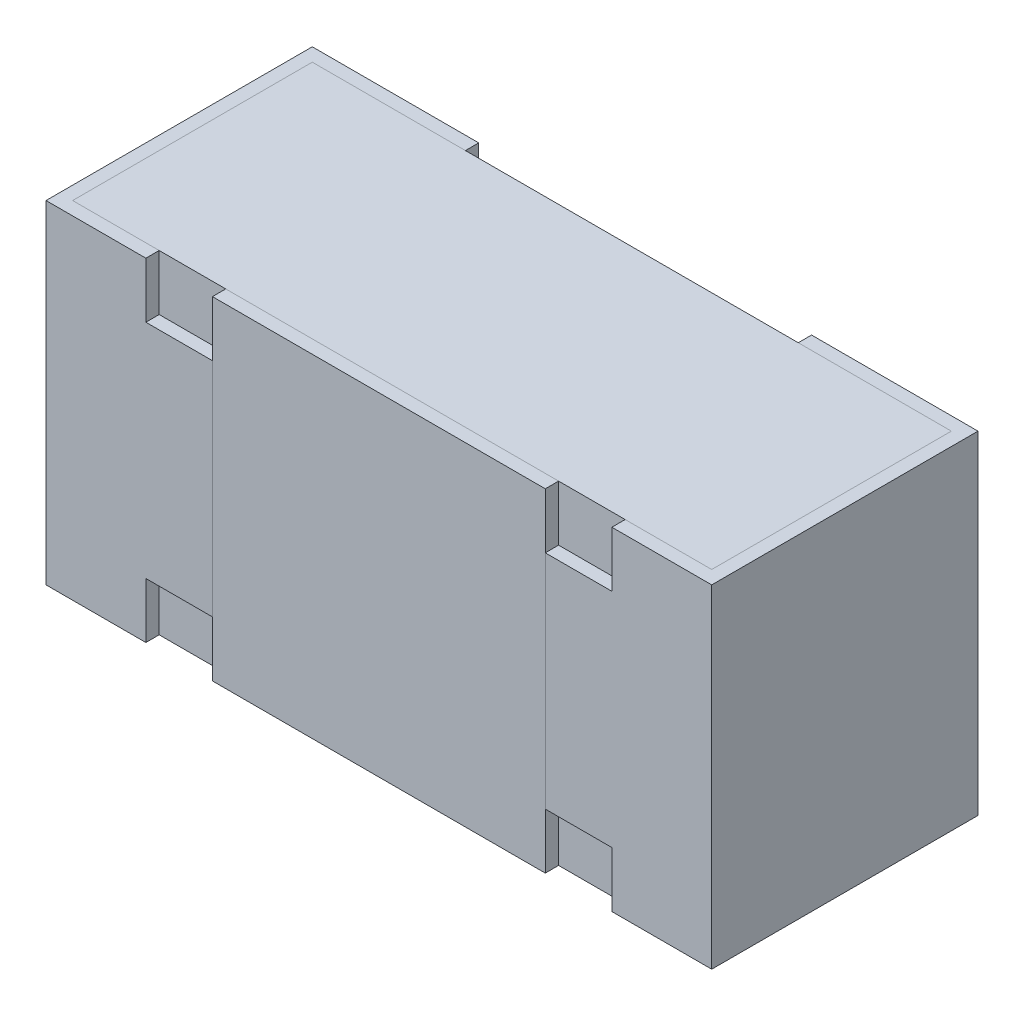
ISO-10303-21;
HEADER;
FILE_DESCRIPTION(('STEP AP214'),'2;1');
FILE_NAME('part.step','',(''),(''),'','','');
FILE_SCHEMA(('AUTOMOTIVE_DESIGN { 1 0 10303 214 1 1 1 1 }'));
ENDSEC;
DATA;
#1=APPLICATION_CONTEXT('core data for automotive mechanical design processes');
#2=APPLICATION_PROTOCOL_DEFINITION('international standard','automotive_design',2000,#1);
#3=PRODUCT_CONTEXT('',#1,'mechanical');
#4=PRODUCT('Part','Part','',(#3));
#5=PRODUCT_RELATED_PRODUCT_CATEGORY('part','',(#4));
#6=PRODUCT_DEFINITION_FORMATION('','',#4);
#7=PRODUCT_DEFINITION_CONTEXT('part definition',#1,'design');
#8=PRODUCT_DEFINITION('design','',#6,#7);
#9=PRODUCT_DEFINITION_SHAPE('','',#8);
#10=(LENGTH_UNIT() NAMED_UNIT(*) SI_UNIT(.MILLI.,.METRE.));
#11=(NAMED_UNIT(*) PLANE_ANGLE_UNIT() SI_UNIT($,.RADIAN.));
#12=(NAMED_UNIT(*) SI_UNIT($,.STERADIAN.) SOLID_ANGLE_UNIT());
#13=UNCERTAINTY_MEASURE_WITH_UNIT(LENGTH_MEASURE(1.E-05),#10,'distance_accuracy_value','');
#14=(GEOMETRIC_REPRESENTATION_CONTEXT(3) GLOBAL_UNCERTAINTY_ASSIGNED_CONTEXT((#13)) GLOBAL_UNIT_ASSIGNED_CONTEXT((#10,
#11,#12)) REPRESENTATION_CONTEXT('',''));
#15=CARTESIAN_POINT('',(0.,0.,0.));
#16=DIRECTION('',(0.,0.,1.));
#17=DIRECTION('',(1.,0.,0.));
#18=AXIS2_PLACEMENT_3D('',#15,#16,#17);
#19=CARTESIAN_POINT('',(6.34999999999694E-05,-0.24990348,0.01278128));
#20=DIRECTION('',(0.,-1.,0.));
#21=DIRECTION('',(1.,0.,0.));
#22=AXIS2_PLACEMENT_3D('',#19,#20,#21);
#23=PLANE('',#22);
#24=DIRECTION('',(0.,0.,-1.));
#25=VECTOR('',#24,1.);
#26=CARTESIAN_POINT('',(0.480063499999999,-0.24990348,0.0327812800000001));
#27=LINE('',#26,#25);
#28=CARTESIAN_POINT('',(0.480063499999999,-0.24990348,0.39278128));
#29=VERTEX_POINT('',#28);
#30=CARTESIAN_POINT('',(0.480063499999999,-0.24990348,0.0327812800000001));
#31=VERTEX_POINT('',#30);
#32=EDGE_CURVE('P0_E10',#29,#31,#27,.T.);
#33=ORIENTED_EDGE('',*,*,#32,.F.);
#34=DIRECTION('',(1.,0.,0.));
#35=VECTOR('',#34,1.);
#36=CARTESIAN_POINT('',(0.480063499999999,-0.24990348,0.39278128));
#37=LINE('',#36,#35);
#38=CARTESIAN_POINT('',(-0.4799365,-0.24990348,0.39278128));
#39=VERTEX_POINT('',#38);
#40=EDGE_CURVE('P0_E23',#39,#29,#37,.T.);
#41=ORIENTED_EDGE('',*,*,#40,.F.);
#42=DIRECTION('',(0.,0.,1.));
#43=VECTOR('',#42,1.);
#44=CARTESIAN_POINT('',(-0.4799365,-0.24990348,0.0327812800000001));
#45=LINE('',#44,#43);
#46=CARTESIAN_POINT('',(-0.4799365,-0.24990348,0.0327812800000001));
#47=VERTEX_POINT('',#46);
#48=EDGE_CURVE('P0_E68',#47,#39,#45,.T.);
#49=ORIENTED_EDGE('',*,*,#48,.F.);
#50=DIRECTION('',(-1.,0.,0.));
#51=VECTOR('',#50,1.);
#52=CARTESIAN_POINT('',(0.480063499999999,-0.24990348,0.0327812800000001));
#53=LINE('',#52,#51);
#54=EDGE_CURVE('P0_E83',#31,#47,#53,.T.);
#55=ORIENTED_EDGE('',*,*,#54,.F.);
#56=EDGE_LOOP('',(#33,#41,#49,#55));
#57=FACE_BOUND('',#56,.T.);
#58=ADVANCED_FACE('P0_F16',(#57),#23,.T.);
#59=CARTESIAN_POINT('',(6.35000000000306E-05,0.25009652,0.01278128));
#60=DIRECTION('',(0.,-1.,0.));
#61=DIRECTION('',(1.,0.,0.));
#62=AXIS2_PLACEMENT_3D('',#59,#60,#61);
#63=PLANE('',#62);
#64=DIRECTION('',(0.,0.,-1.));
#65=VECTOR('',#64,1.);
#66=CARTESIAN_POINT('',(0.4800635,0.25009652,0.0327812800000001));
#67=LINE('',#66,#65);
#68=CARTESIAN_POINT('',(0.4800635,0.25009652,0.39278128));
#69=VERTEX_POINT('',#68);
#70=CARTESIAN_POINT('',(0.4800635,0.25009652,0.0327812800000001));
#71=VERTEX_POINT('',#70);
#72=EDGE_CURVE('P0_E81',#69,#71,#67,.T.);
#73=ORIENTED_EDGE('',*,*,#72,.T.);
#74=DIRECTION('',(-1.,0.,0.));
#75=VECTOR('',#74,1.);
#76=CARTESIAN_POINT('',(0.4800635,0.25009652,0.0327812800000001));
#77=LINE('',#76,#75);
#78=CARTESIAN_POINT('',(-0.479936499999999,0.25009652,0.0327812800000001));
#79=VERTEX_POINT('',#78);
#80=EDGE_CURVE('P0_E60',#71,#79,#77,.T.);
#81=ORIENTED_EDGE('',*,*,#80,.T.);
#82=DIRECTION('',(0.,0.,1.));
#83=VECTOR('',#82,1.);
#84=CARTESIAN_POINT('',(-0.479936499999999,0.25009652,0.0327812800000001));
#85=LINE('',#84,#83);
#86=CARTESIAN_POINT('',(-0.479936499999999,0.25009652,0.39278128));
#87=VERTEX_POINT('',#86);
#88=EDGE_CURVE('P0_E53',#79,#87,#85,.T.);
#89=ORIENTED_EDGE('',*,*,#88,.T.);
#90=DIRECTION('',(1.,0.,0.));
#91=VECTOR('',#90,1.);
#92=CARTESIAN_POINT('',(0.4800635,0.25009652,0.39278128));
#93=LINE('',#92,#91);
#94=EDGE_CURVE('P0_E57',#87,#69,#93,.T.);
#95=ORIENTED_EDGE('',*,*,#94,.T.);
#96=EDGE_LOOP('',(#73,#81,#89,#95));
#97=FACE_BOUND('',#96,.T.);
#98=ADVANCED_FACE('P0_F55',(#97),#63,.F.);
#99=CARTESIAN_POINT('',(0.480063499999999,-1.2751839294381,0.03278128));
#100=DIRECTION('',(0.,0.,-1.));
#101=DIRECTION('',(-1.,0.,0.));
#102=AXIS2_PLACEMENT_3D('',#99,#100,#101);
#103=PLANE('',#102);
#104=DIRECTION('',(0.,1.,0.));
#105=VECTOR('',#104,1.);
#106=CARTESIAN_POINT('',(0.480063499999999,-1.2751839294381,0.03278128));
#107=LINE('',#106,#105);
#108=EDGE_CURVE('P0_E75',#31,#71,#107,.T.);
#109=ORIENTED_EDGE('',*,*,#108,.F.);
#110=ORIENTED_EDGE('',*,*,#54,.T.);
#111=DIRECTION('',(0.,1.,0.));
#112=VECTOR('',#111,1.);
#113=CARTESIAN_POINT('',(-0.4799365,-1.2751839294381,0.03278128));
#114=LINE('',#113,#112);
#115=EDGE_CURVE('P0_E70',#47,#79,#114,.T.);
#116=ORIENTED_EDGE('',*,*,#115,.T.);
#117=ORIENTED_EDGE('',*,*,#80,.F.);
#118=EDGE_LOOP('',(#109,#110,#116,#117));
#119=FACE_BOUND('',#118,.T.);
#120=ADVANCED_FACE('P0_F90',(#119),#103,.T.);
#121=CARTESIAN_POINT('',(-0.4799365,-1.2751839294381,0.03278128));
#122=DIRECTION('',(-1.,0.,0.));
#123=DIRECTION('',(0.,-1.,0.));
#124=AXIS2_PLACEMENT_3D('',#121,#122,#123);
#125=PLANE('',#124);
#126=ORIENTED_EDGE('',*,*,#115,.F.);
#127=ORIENTED_EDGE('',*,*,#48,.T.);
#128=DIRECTION('',(0.,1.,0.));
#129=VECTOR('',#128,1.);
#130=CARTESIAN_POINT('',(-0.4799365,-1.2751839294381,0.39278128));
#131=LINE('',#130,#129);
#132=EDGE_CURVE('P0_E65',#39,#87,#131,.T.);
#133=ORIENTED_EDGE('',*,*,#132,.T.);
#134=ORIENTED_EDGE('',*,*,#88,.F.);
#135=EDGE_LOOP('',(#126,#127,#133,#134));
#136=FACE_BOUND('',#135,.T.);
#137=ADVANCED_FACE('P0_F66',(#136),#125,.T.);
#138=CARTESIAN_POINT('',(0.480063499999999,-1.2751839294381,0.39278128));
#139=DIRECTION('',(0.,0.,1.));
#140=DIRECTION('',(0.,1.,0.));
#141=AXIS2_PLACEMENT_3D('',#138,#139,#140);
#142=PLANE('',#141);
#143=ORIENTED_EDGE('',*,*,#132,.F.);
#144=ORIENTED_EDGE('',*,*,#40,.T.);
#145=DIRECTION('',(0.,1.,0.));
#146=VECTOR('',#145,1.);
#147=CARTESIAN_POINT('',(0.480063499999999,-1.2751839294381,0.39278128));
#148=LINE('',#147,#146);
#149=EDGE_CURVE('P0_E71',#29,#69,#148,.T.);
#150=ORIENTED_EDGE('',*,*,#149,.T.);
#151=ORIENTED_EDGE('',*,*,#94,.F.);
#152=EDGE_LOOP('',(#143,#144,#150,#151));
#153=FACE_BOUND('',#152,.T.);
#154=ADVANCED_FACE('P0_F73',(#153),#142,.T.);
#155=CARTESIAN_POINT('',(0.480063499999999,-1.2751839294381,0.03278128));
#156=DIRECTION('',(1.,0.,0.));
#157=DIRECTION('',(0.,1.,0.));
#158=AXIS2_PLACEMENT_3D('',#155,#156,#157);
#159=PLANE('',#158);
#160=ORIENTED_EDGE('',*,*,#149,.F.);
#161=ORIENTED_EDGE('',*,*,#32,.T.);
#162=ORIENTED_EDGE('',*,*,#108,.T.);
#163=ORIENTED_EDGE('',*,*,#72,.F.);
#164=EDGE_LOOP('',(#160,#161,#162,#163));
#165=FACE_BOUND('',#164,.T.);
#166=ADVANCED_FACE('P0_F86',(#165),#159,.T.);
#167=CLOSED_SHELL('',(#58,#98,#120,#137,#154,#166));
#168=MANIFOLD_SOLID_BREP('P0_B1',#167);
#169=CARTESIAN_POINT('',(0.2500635,-0.24990348,-0.314325501186547));
#170=DIRECTION('',(1.,0.,0.));
#171=DIRECTION('',(0.,1.,0.));
#172=AXIS2_PLACEMENT_3D('',#169,#170,#171);
#173=PLANE('',#172);
#174=DIRECTION('',(0.,-1.,0.));
#175=VECTOR('',#174,1.);
#176=CARTESIAN_POINT('',(0.2500635,-0.24990348,0.39278128));
#177=LINE('',#176,#175);
#178=CARTESIAN_POINT('',(0.250063499999999,0.25009652,0.39278128));
#179=VERTEX_POINT('',#178);
#180=CARTESIAN_POINT('',(0.2500635,-0.24990348,0.39278128));
#181=VERTEX_POINT('',#180);
#182=EDGE_CURVE('P1_E11',#179,#181,#177,.T.);
#183=ORIENTED_EDGE('',*,*,#182,.F.);
#184=DIRECTION('',(0.,0.,1.));
#185=VECTOR('',#184,1.);
#186=CARTESIAN_POINT('',(0.250063499999999,0.25009652,-0.314325501186547));
#187=LINE('',#186,#185);
#188=CARTESIAN_POINT('',(0.250063499999999,0.25009652,0.41278128));
#189=VERTEX_POINT('',#188);
#190=EDGE_CURVE('P1_E24',#179,#189,#187,.T.);
#191=ORIENTED_EDGE('',*,*,#190,.T.);
#192=DIRECTION('',(0.,1.,0.));
#193=VECTOR('',#192,1.);
#194=CARTESIAN_POINT('',(0.2500635,-0.24990348,0.41278128));
#195=LINE('',#194,#193);
#196=CARTESIAN_POINT('',(0.2500635,-0.24990348,0.41278128));
#197=VERTEX_POINT('',#196);
#198=EDGE_CURVE('P1_E72',#197,#189,#195,.T.);
#199=ORIENTED_EDGE('',*,*,#198,.F.);
#200=DIRECTION('',(0.,0.,1.));
#201=VECTOR('',#200,1.);
#202=CARTESIAN_POINT('',(0.2500635,-0.24990348,-0.314325501186547));
#203=LINE('',#202,#201);
#204=EDGE_CURVE('P1_E86',#181,#197,#203,.T.);
#205=ORIENTED_EDGE('',*,*,#204,.F.);
#206=EDGE_LOOP('',(#183,#191,#199,#205));
#207=FACE_BOUND('',#206,.T.);
#208=ADVANCED_FACE('P1_F17',(#207),#173,.T.);
#209=CARTESIAN_POINT('',(0.2500635,-0.24990348,-0.314325501186547));
#210=DIRECTION('',(0.,-1.,0.));
#211=DIRECTION('',(1.,0.,0.));
#212=AXIS2_PLACEMENT_3D('',#209,#210,#211);
#213=PLANE('',#212);
#214=DIRECTION('',(-1.,0.,0.));
#215=VECTOR('',#214,1.);
#216=CARTESIAN_POINT('',(0.2500635,-0.24990348,0.39278128));
#217=LINE('',#216,#215);
#218=CARTESIAN_POINT('',(-0.2499365,-0.24990348,0.39278128));
#219=VERTEX_POINT('',#218);
#220=EDGE_CURVE('P1_E84',#181,#219,#217,.T.);
#221=ORIENTED_EDGE('',*,*,#220,.F.);
#222=ORIENTED_EDGE('',*,*,#204,.T.);
#223=DIRECTION('',(1.,0.,0.));
#224=VECTOR('',#223,1.);
#225=CARTESIAN_POINT('',(0.2500635,-0.24990348,0.41278128));
#226=LINE('',#225,#224);
#227=CARTESIAN_POINT('',(-0.2499365,-0.24990348,0.41278128));
#228=VERTEX_POINT('',#227);
#229=EDGE_CURVE('P1_E82',#228,#197,#226,.T.);
#230=ORIENTED_EDGE('',*,*,#229,.F.);
#231=DIRECTION('',(0.,0.,1.));
#232=VECTOR('',#231,1.);
#233=CARTESIAN_POINT('',(-0.2499365,-0.24990348,-0.314325501186547));
#234=LINE('',#233,#232);
#235=EDGE_CURVE('P1_E75',#219,#228,#234,.T.);
#236=ORIENTED_EDGE('',*,*,#235,.F.);
#237=EDGE_LOOP('',(#221,#222,#230,#236));
#238=FACE_BOUND('',#237,.T.);
#239=ADVANCED_FACE('P1_F90',(#238),#213,.T.);
#240=CARTESIAN_POINT('',(-0.2499365,-0.24990348,-0.314325501186547));
#241=DIRECTION('',(-1.,0.,0.));
#242=DIRECTION('',(0.,0.,1.));
#243=AXIS2_PLACEMENT_3D('',#240,#241,#242);
#244=PLANE('',#243);
#245=DIRECTION('',(0.,1.,0.));
#246=VECTOR('',#245,1.);
#247=CARTESIAN_POINT('',(-0.2499365,-0.24990348,0.39278128));
#248=LINE('',#247,#246);
#249=CARTESIAN_POINT('',(-0.2499365,0.25009652,0.39278128));
#250=VERTEX_POINT('',#249);
#251=EDGE_CURVE('P1_E76',#219,#250,#248,.T.);
#252=ORIENTED_EDGE('',*,*,#251,.F.);
#253=ORIENTED_EDGE('',*,*,#235,.T.);
#254=DIRECTION('',(0.,-1.,0.));
#255=VECTOR('',#254,1.);
#256=CARTESIAN_POINT('',(-0.2499365,-0.24990348,0.41278128));
#257=LINE('',#256,#255);
#258=CARTESIAN_POINT('',(-0.2499365,0.25009652,0.41278128));
#259=VERTEX_POINT('',#258);
#260=EDGE_CURVE('P1_E64',#259,#228,#257,.T.);
#261=ORIENTED_EDGE('',*,*,#260,.F.);
#262=DIRECTION('',(0.,0.,1.));
#263=VECTOR('',#262,1.);
#264=CARTESIAN_POINT('',(-0.2499365,0.25009652,-0.314325501186547));
#265=LINE('',#264,#263);
#266=EDGE_CURVE('P1_E53',#250,#259,#265,.T.);
#267=ORIENTED_EDGE('',*,*,#266,.F.);
#268=EDGE_LOOP('',(#252,#253,#261,#267));
#269=FACE_BOUND('',#268,.T.);
#270=ADVANCED_FACE('P1_F74',(#269),#244,.T.);
#271=CARTESIAN_POINT('',(0.250063499999999,0.25009652,-0.314325501186547));
#272=DIRECTION('',(0.,1.,0.));
#273=DIRECTION('',(-1.,0.,0.));
#274=AXIS2_PLACEMENT_3D('',#271,#272,#273);
#275=PLANE('',#274);
#276=DIRECTION('',(1.,0.,0.));
#277=VECTOR('',#276,1.);
#278=CARTESIAN_POINT('',(0.250063499999999,0.25009652,0.39278128));
#279=LINE('',#278,#277);
#280=EDGE_CURVE('P1_E59',#250,#179,#279,.T.);
#281=ORIENTED_EDGE('',*,*,#280,.F.);
#282=ORIENTED_EDGE('',*,*,#266,.T.);
#283=DIRECTION('',(-1.,0.,0.));
#284=VECTOR('',#283,1.);
#285=CARTESIAN_POINT('',(0.250063499999999,0.25009652,0.41278128));
#286=LINE('',#285,#284);
#287=EDGE_CURVE('P1_E57',#189,#259,#286,.T.);
#288=ORIENTED_EDGE('',*,*,#287,.F.);
#289=ORIENTED_EDGE('',*,*,#190,.F.);
#290=EDGE_LOOP('',(#281,#282,#288,#289));
#291=FACE_BOUND('',#290,.T.);
#292=ADVANCED_FACE('P1_F55',(#291),#275,.T.);
#293=CARTESIAN_POINT('',(6.35E-05,9.65199999999755E-05,0.41278128));
#294=DIRECTION('',(0.,0.,1.));
#295=DIRECTION('',(0.,1.,0.));
#296=AXIS2_PLACEMENT_3D('',#293,#294,#295);
#297=PLANE('',#296);
#298=ORIENTED_EDGE('',*,*,#198,.T.);
#299=ORIENTED_EDGE('',*,*,#287,.T.);
#300=ORIENTED_EDGE('',*,*,#260,.T.);
#301=ORIENTED_EDGE('',*,*,#229,.T.);
#302=EDGE_LOOP('',(#298,#299,#300,#301));
#303=FACE_BOUND('',#302,.T.);
#304=ADVANCED_FACE('P1_F68',(#303),#297,.T.);
#305=CARTESIAN_POINT('',(0.480063499999999,-1.2751839294381,0.39278128));
#306=DIRECTION('',(0.,0.,1.));
#307=DIRECTION('',(0.,1.,0.));
#308=AXIS2_PLACEMENT_3D('',#305,#306,#307);
#309=PLANE('',#308);
#310=ORIENTED_EDGE('',*,*,#182,.T.);
#311=ORIENTED_EDGE('',*,*,#220,.T.);
#312=ORIENTED_EDGE('',*,*,#251,.T.);
#313=ORIENTED_EDGE('',*,*,#280,.T.);
#314=EDGE_LOOP('',(#310,#311,#312,#313));
#315=FACE_BOUND('',#314,.T.);
#316=ADVANCED_FACE('P1_F91',(#315),#309,.F.);
#317=CLOSED_SHELL('',(#208,#239,#270,#292,#304,#316));
#318=MANIFOLD_SOLID_BREP('P1_B1',#317);
#319=CARTESIAN_POINT('',(0.2500635,0.25009652,0.0327812800000001));
#320=DIRECTION('',(1.,0.,0.));
#321=DIRECTION('',(0.,1.,0.));
#322=AXIS2_PLACEMENT_3D('',#319,#320,#321);
#323=PLANE('',#322);
#324=DIRECTION('',(0.,0.,1.));
#325=VECTOR('',#324,1.);
#326=CARTESIAN_POINT('',(0.2500635,-0.24990348,0.0327812800000001));
#327=LINE('',#326,#325);
#328=CARTESIAN_POINT('',(0.2500635,-0.24990348,0.01278128));
#329=VERTEX_POINT('',#328);
#330=CARTESIAN_POINT('',(0.2500635,-0.24990348,0.0327812800000001));
#331=VERTEX_POINT('',#330);
#332=EDGE_CURVE('P2_E11',#329,#331,#327,.T.);
#333=ORIENTED_EDGE('',*,*,#332,.T.);
#334=DIRECTION('',(0.,-1.,0.));
#335=VECTOR('',#334,1.);
#336=CARTESIAN_POINT('',(0.2500635,0.25009652,0.0327812800000001));
#337=LINE('',#336,#335);
#338=CARTESIAN_POINT('',(0.2500635,0.25009652,0.0327812800000001));
#339=VERTEX_POINT('',#338);
#340=EDGE_CURVE('P2_E24',#339,#331,#337,.T.);
#341=ORIENTED_EDGE('',*,*,#340,.F.);
#342=DIRECTION('',(0.,0.,1.));
#343=VECTOR('',#342,1.);
#344=CARTESIAN_POINT('',(0.2500635,0.25009652,0.0327812800000001));
#345=LINE('',#344,#343);
#346=CARTESIAN_POINT('',(0.2500635,0.25009652,0.01278128));
#347=VERTEX_POINT('',#346);
#348=EDGE_CURVE('P2_E186',#347,#339,#345,.T.);
#349=ORIENTED_EDGE('',*,*,#348,.F.);
#350=DIRECTION('',(0.,-1.,0.));
#351=VECTOR('',#350,1.);
#352=CARTESIAN_POINT('',(0.2500635,0.25009652,0.01278128));
#353=LINE('',#352,#351);
#354=EDGE_CURVE('P2_E108',#347,#329,#353,.T.);
#355=ORIENTED_EDGE('',*,*,#354,.T.);
#356=EDGE_LOOP('',(#333,#341,#349,#355));
#357=FACE_BOUND('',#356,.T.);
#358=ADVANCED_FACE('P2_F17',(#357),#323,.F.);
#359=CARTESIAN_POINT('',(0.2500635,0.25009652,0.0327812800000001));
#360=DIRECTION('',(0.,0.,-1.));
#361=DIRECTION('',(-1.,0.,0.));
#362=AXIS2_PLACEMENT_3D('',#359,#360,#361);
#363=PLANE('',#362);
#364=DIRECTION('',(1.,0.,0.));
#365=VECTOR('',#364,1.);
#366=CARTESIAN_POINT('',(0.2500635,-0.24990348,0.0327812800000001));
#367=LINE('',#366,#365);
#368=CARTESIAN_POINT('',(0.480063499999999,-0.24990348,0.0327812800000001));
#369=VERTEX_POINT('',#368);
#370=EDGE_CURVE('P2_E183',#331,#369,#367,.T.);
#371=ORIENTED_EDGE('',*,*,#370,.T.);
#372=DIRECTION('',(0.,-1.,0.));
#373=VECTOR('',#372,1.);
#374=CARTESIAN_POINT('',(0.4800635,0.25009652,0.0327812800000001));
#375=LINE('',#374,#373);
#376=CARTESIAN_POINT('',(0.4800635,0.25009652,0.0327812800000001));
#377=VERTEX_POINT('',#376);
#378=EDGE_CURVE('P2_E180',#377,#369,#375,.T.);
#379=ORIENTED_EDGE('',*,*,#378,.F.);
#380=DIRECTION('',(1.,0.,0.));
#381=VECTOR('',#380,1.);
#382=CARTESIAN_POINT('',(0.2500635,0.25009652,0.0327812800000001));
#383=LINE('',#382,#381);
#384=EDGE_CURVE('P2_E177',#339,#377,#383,.T.);
#385=ORIENTED_EDGE('',*,*,#384,.F.);
#386=ORIENTED_EDGE('',*,*,#340,.T.);
#387=EDGE_LOOP('',(#371,#379,#385,#386));
#388=FACE_BOUND('',#387,.T.);
#389=ADVANCED_FACE('P2_F190',(#388),#363,.F.);
#390=CARTESIAN_POINT('',(0.4800635,0.25009652,0.0327812800000001));
#391=DIRECTION('',(1.,0.,0.));
#392=DIRECTION('',(0.,1.,0.));
#393=AXIS2_PLACEMENT_3D('',#390,#391,#392);
#394=PLANE('',#393);
#395=DIRECTION('',(0.,0.,1.));
#396=VECTOR('',#395,1.);
#397=CARTESIAN_POINT('',(0.480063499999999,-0.24990348,0.0327812800000001));
#398=LINE('',#397,#396);
#399=CARTESIAN_POINT('',(0.480063499999999,-0.24990348,0.39278128));
#400=VERTEX_POINT('',#399);
#401=EDGE_CURVE('P2_E174',#369,#400,#398,.T.);
#402=ORIENTED_EDGE('',*,*,#401,.T.);
#403=DIRECTION('',(0.,-1.,0.));
#404=VECTOR('',#403,1.);
#405=CARTESIAN_POINT('',(0.4800635,0.25009652,0.39278128));
#406=LINE('',#405,#404);
#407=CARTESIAN_POINT('',(0.4800635,0.25009652,0.39278128));
#408=VERTEX_POINT('',#407);
#409=EDGE_CURVE('P2_E171',#408,#400,#406,.T.);
#410=ORIENTED_EDGE('',*,*,#409,.F.);
#411=DIRECTION('',(0.,0.,1.));
#412=VECTOR('',#411,1.);
#413=CARTESIAN_POINT('',(0.4800635,0.25009652,0.0327812800000001));
#414=LINE('',#413,#412);
#415=EDGE_CURVE('P2_E169',#377,#408,#414,.T.);
#416=ORIENTED_EDGE('',*,*,#415,.F.);
#417=ORIENTED_EDGE('',*,*,#378,.T.);
#418=EDGE_LOOP('',(#402,#410,#416,#417));
#419=FACE_BOUND('',#418,.T.);
#420=ADVANCED_FACE('P2_F199',(#419),#394,.F.);
#421=CARTESIAN_POINT('',(0.4800635,0.25009652,0.39278128));
#422=DIRECTION('',(0.,0.,1.));
#423=DIRECTION('',(0.,1.,0.));
#424=AXIS2_PLACEMENT_3D('',#421,#422,#423);
#425=PLANE('',#424);
#426=DIRECTION('',(1.,0.,0.));
#427=VECTOR('',#426,1.);
#428=CARTESIAN_POINT('',(0.250063499999999,0.166763186666667,0.39278128));
#429=LINE('',#428,#427);
#430=CARTESIAN_POINT('',(0.250063499999999,0.166763186666667,0.39278128));
#431=VERTEX_POINT('',#430);
#432=CARTESIAN_POINT('',(0.350063499999999,0.166763186666667,0.39278128));
#433=VERTEX_POINT('',#432);
#434=EDGE_CURVE('P2_E167',#431,#433,#429,.T.);
#435=ORIENTED_EDGE('',*,*,#434,.T.);
#436=DIRECTION('',(0.,1.,0.));
#437=VECTOR('',#436,1.);
#438=CARTESIAN_POINT('',(0.3500635,0.25009652,0.39278128));
#439=LINE('',#438,#437);
#440=CARTESIAN_POINT('',(0.3500635,0.25009652,0.39278128));
#441=VERTEX_POINT('',#440);
#442=EDGE_CURVE('P2_E165',#433,#441,#439,.T.);
#443=ORIENTED_EDGE('',*,*,#442,.T.);
#444=DIRECTION('',(-1.,0.,0.));
#445=VECTOR('',#444,1.);
#446=CARTESIAN_POINT('',(0.4800635,0.25009652,0.39278128));
#447=LINE('',#446,#445);
#448=EDGE_CURVE('P2_E163',#408,#441,#447,.T.);
#449=ORIENTED_EDGE('',*,*,#448,.F.);
#450=ORIENTED_EDGE('',*,*,#409,.T.);
#451=DIRECTION('',(-1.,0.,0.));
#452=VECTOR('',#451,1.);
#453=CARTESIAN_POINT('',(0.480063499999999,-0.24990348,0.39278128));
#454=LINE('',#453,#452);
#455=CARTESIAN_POINT('',(0.350063499999999,-0.24990348,0.39278128));
#456=VERTEX_POINT('',#455);
#457=EDGE_CURVE('P2_E161',#400,#456,#454,.T.);
#458=ORIENTED_EDGE('',*,*,#457,.T.);
#459=DIRECTION('',(0.,1.,0.));
#460=VECTOR('',#459,1.);
#461=CARTESIAN_POINT('',(0.350063499999999,-0.24990348,0.39278128));
#462=LINE('',#461,#460);
#463=CARTESIAN_POINT('',(0.350063499999999,-0.166570146666667,0.39278128));
#464=VERTEX_POINT('',#463);
#465=EDGE_CURVE('P2_E159',#456,#464,#462,.T.);
#466=ORIENTED_EDGE('',*,*,#465,.T.);
#467=DIRECTION('',(-1.,0.,0.));
#468=VECTOR('',#467,1.);
#469=CARTESIAN_POINT('',(0.250063499999999,-0.166570146666667,0.39278128));
#470=LINE('',#469,#468);
#471=CARTESIAN_POINT('',(0.250063499999999,-0.166570146666667,0.39278128));
#472=VERTEX_POINT('',#471);
#473=EDGE_CURVE('P2_E156',#464,#472,#470,.T.);
#474=ORIENTED_EDGE('',*,*,#473,.T.);
#475=DIRECTION('',(0.,-1.,0.));
#476=VECTOR('',#475,1.);
#477=CARTESIAN_POINT('',(0.2500635,0.25009652,0.39278128));
#478=LINE('',#477,#476);
#479=EDGE_CURVE('P2_E153',#431,#472,#478,.T.);
#480=ORIENTED_EDGE('',*,*,#479,.F.);
#481=EDGE_LOOP('',(#435,#443,#449,#450,#458,#466,#474,#480));
#482=FACE_BOUND('',#481,.T.);
#483=ADVANCED_FACE('P2_F197',(#482),#425,.F.);
#484=CARTESIAN_POINT('',(0.2500635,0.25009652,0.41278128));
#485=DIRECTION('',(1.,0.,0.));
#486=DIRECTION('',(0.,1.,0.));
#487=AXIS2_PLACEMENT_3D('',#484,#485,#486);
#488=PLANE('',#487);
#489=DIRECTION('',(0.,-1.,0.));
#490=VECTOR('',#489,1.);
#491=CARTESIAN_POINT('',(0.2500635,0.25009652,0.41278128));
#492=LINE('',#491,#490);
#493=CARTESIAN_POINT('',(0.250063499999999,0.166763186666667,0.41278128));
#494=VERTEX_POINT('',#493);
#495=CARTESIAN_POINT('',(0.250063499999999,-0.166570146666667,0.41278128));
#496=VERTEX_POINT('',#495);
#497=EDGE_CURVE('P2_E150',#494,#496,#492,.T.);
#498=ORIENTED_EDGE('',*,*,#497,.F.);
#499=DIRECTION('',(0.,0.,1.));
#500=VECTOR('',#499,1.);
#501=CARTESIAN_POINT('',(0.250063499999999,0.166763186666667,0.39278128));
#502=LINE('',#501,#500);
#503=EDGE_CURVE('P2_E148',#431,#494,#502,.T.);
#504=ORIENTED_EDGE('',*,*,#503,.F.);
#505=ORIENTED_EDGE('',*,*,#479,.T.);
#506=DIRECTION('',(0.,0.,1.));
#507=VECTOR('',#506,1.);
#508=CARTESIAN_POINT('',(0.250063499999999,-0.166570146666667,0.39278128));
#509=LINE('',#508,#507);
#510=EDGE_CURVE('P2_E146',#472,#496,#509,.T.);
#511=ORIENTED_EDGE('',*,*,#510,.T.);
#512=EDGE_LOOP('',(#498,#504,#505,#511));
#513=FACE_BOUND('',#512,.T.);
#514=ADVANCED_FACE('P2_F221',(#513),#488,.F.);
#515=CARTESIAN_POINT('',(0.5000635,0.25009652,0.41278128));
#516=DIRECTION('',(0.,0.,-1.));
#517=DIRECTION('',(0.,-1.,0.));
#518=AXIS2_PLACEMENT_3D('',#515,#516,#517);
#519=PLANE('',#518);
#520=DIRECTION('',(1.,0.,0.));
#521=VECTOR('',#520,1.);
#522=CARTESIAN_POINT('',(0.5000635,0.25009652,0.41278128));
#523=LINE('',#522,#521);
#524=CARTESIAN_POINT('',(0.3500635,0.25009652,0.41278128));
#525=VERTEX_POINT('',#524);
#526=CARTESIAN_POINT('',(0.5000635,0.25009652,0.41278128));
#527=VERTEX_POINT('',#526);
#528=EDGE_CURVE('P2_E119',#525,#527,#523,.T.);
#529=ORIENTED_EDGE('',*,*,#528,.F.);
#530=DIRECTION('',(0.,1.,0.));
#531=VECTOR('',#530,1.);
#532=CARTESIAN_POINT('',(0.3500635,0.25009652,0.41278128));
#533=LINE('',#532,#531);
#534=CARTESIAN_POINT('',(0.350063499999999,0.166763186666667,0.41278128));
#535=VERTEX_POINT('',#534);
#536=EDGE_CURVE('P2_E142',#535,#525,#533,.T.);
#537=ORIENTED_EDGE('',*,*,#536,.F.);
#538=DIRECTION('',(1.,0.,0.));
#539=VECTOR('',#538,1.);
#540=CARTESIAN_POINT('',(0.250063499999999,0.166763186666667,0.41278128));
#541=LINE('',#540,#539);
#542=EDGE_CURVE('P2_E140',#494,#535,#541,.T.);
#543=ORIENTED_EDGE('',*,*,#542,.F.);
#544=ORIENTED_EDGE('',*,*,#497,.T.);
#545=DIRECTION('',(-1.,0.,0.));
#546=VECTOR('',#545,1.);
#547=CARTESIAN_POINT('',(0.250063499999999,-0.166570146666667,0.41278128));
#548=LINE('',#547,#546);
#549=CARTESIAN_POINT('',(0.350063499999999,-0.166570146666667,0.41278128));
#550=VERTEX_POINT('',#549);
#551=EDGE_CURVE('P2_E137',#550,#496,#548,.T.);
#552=ORIENTED_EDGE('',*,*,#551,.F.);
#553=DIRECTION('',(0.,1.,0.));
#554=VECTOR('',#553,1.);
#555=CARTESIAN_POINT('',(0.350063499999999,-0.24990348,0.41278128));
#556=LINE('',#555,#554);
#557=CARTESIAN_POINT('',(0.350063499999999,-0.24990348,0.41278128));
#558=VERTEX_POINT('',#557);
#559=EDGE_CURVE('P2_E135',#558,#550,#556,.T.);
#560=ORIENTED_EDGE('',*,*,#559,.F.);
#561=DIRECTION('',(1.,0.,0.));
#562=VECTOR('',#561,1.);
#563=CARTESIAN_POINT('',(0.5000635,-0.24990348,0.41278128));
#564=LINE('',#563,#562);
#565=CARTESIAN_POINT('',(0.5000635,-0.24990348,0.41278128));
#566=VERTEX_POINT('',#565);
#567=EDGE_CURVE('P2_E132',#558,#566,#564,.T.);
#568=ORIENTED_EDGE('',*,*,#567,.T.);
#569=DIRECTION('',(0.,-1.,0.));
#570=VECTOR('',#569,1.);
#571=CARTESIAN_POINT('',(0.5000635,0.25009652,0.41278128));
#572=LINE('',#571,#570);
#573=EDGE_CURVE('P2_E127',#527,#566,#572,.T.);
#574=ORIENTED_EDGE('',*,*,#573,.F.);
#575=EDGE_LOOP('',(#529,#537,#543,#544,#552,#560,#568,#574));
#576=FACE_BOUND('',#575,.T.);
#577=ADVANCED_FACE('P2_F234',(#576),#519,.F.);
#578=CARTESIAN_POINT('',(0.5000635,0.25009652,0.01278128));
#579=DIRECTION('',(-1.,0.,0.));
#580=DIRECTION('',(0.,-1.,0.));
#581=AXIS2_PLACEMENT_3D('',#578,#579,#580);
#582=PLANE('',#581);
#583=DIRECTION('',(0.,0.,-1.));
#584=VECTOR('',#583,1.);
#585=CARTESIAN_POINT('',(0.5000635,-0.24990348,0.0127812799999999));
#586=LINE('',#585,#584);
#587=CARTESIAN_POINT('',(0.5000635,-0.24990348,0.0127812799999999));
#588=VERTEX_POINT('',#587);
#589=EDGE_CURVE('P2_E125',#566,#588,#586,.T.);
#590=ORIENTED_EDGE('',*,*,#589,.T.);
#591=DIRECTION('',(0.,-1.,0.));
#592=VECTOR('',#591,1.);
#593=CARTESIAN_POINT('',(0.5000635,0.25009652,0.01278128));
#594=LINE('',#593,#592);
#595=CARTESIAN_POINT('',(0.5000635,0.25009652,0.01278128));
#596=VERTEX_POINT('',#595);
#597=EDGE_CURVE('P2_E107',#596,#588,#594,.T.);
#598=ORIENTED_EDGE('',*,*,#597,.F.);
#599=DIRECTION('',(0.,0.,-1.));
#600=VECTOR('',#599,1.);
#601=CARTESIAN_POINT('',(0.5000635,0.25009652,0.01278128));
#602=LINE('',#601,#600);
#603=EDGE_CURVE('P2_E115',#527,#596,#602,.T.);
#604=ORIENTED_EDGE('',*,*,#603,.F.);
#605=ORIENTED_EDGE('',*,*,#573,.T.);
#606=EDGE_LOOP('',(#590,#598,#604,#605));
#607=FACE_BOUND('',#606,.T.);
#608=ADVANCED_FACE('P2_F124',(#607),#582,.F.);
#609=CARTESIAN_POINT('',(0.2500635,0.25009652,0.01278128));
#610=DIRECTION('',(0.,0.,1.));
#611=DIRECTION('',(1.,0.,0.));
#612=AXIS2_PLACEMENT_3D('',#609,#610,#611);
#613=PLANE('',#612);
#614=DIRECTION('',(-1.,0.,0.));
#615=VECTOR('',#614,1.);
#616=CARTESIAN_POINT('',(0.2500635,-0.24990348,0.01278128));
#617=LINE('',#616,#615);
#618=EDGE_CURVE('P2_E111',#588,#329,#617,.T.);
#619=ORIENTED_EDGE('',*,*,#618,.T.);
#620=ORIENTED_EDGE('',*,*,#354,.F.);
#621=DIRECTION('',(-1.,0.,0.));
#622=VECTOR('',#621,1.);
#623=CARTESIAN_POINT('',(0.2500635,0.25009652,0.01278128));
#624=LINE('',#623,#622);
#625=EDGE_CURVE('P2_E102',#596,#347,#624,.T.);
#626=ORIENTED_EDGE('',*,*,#625,.F.);
#627=ORIENTED_EDGE('',*,*,#597,.T.);
#628=EDGE_LOOP('',(#619,#620,#626,#627));
#629=FACE_BOUND('',#628,.T.);
#630=ADVANCED_FACE('P2_F105',(#629),#613,.F.);
#631=CARTESIAN_POINT('',(6.35000000000306E-05,0.25009652,0.01278128));
#632=DIRECTION('',(0.,-1.,0.));
#633=DIRECTION('',(1.,0.,0.));
#634=AXIS2_PLACEMENT_3D('',#631,#632,#633);
#635=PLANE('',#634);
#636=ORIENTED_EDGE('',*,*,#448,.T.);
#637=DIRECTION('',(0.,0.,1.));
#638=VECTOR('',#637,1.);
#639=CARTESIAN_POINT('',(0.3500635,0.25009652,0.39278128));
#640=LINE('',#639,#638);
#641=EDGE_CURVE('P2_E112',#441,#525,#640,.T.);
#642=ORIENTED_EDGE('',*,*,#641,.T.);
#643=ORIENTED_EDGE('',*,*,#528,.T.);
#644=ORIENTED_EDGE('',*,*,#603,.T.);
#645=ORIENTED_EDGE('',*,*,#625,.T.);
#646=ORIENTED_EDGE('',*,*,#348,.T.);
#647=ORIENTED_EDGE('',*,*,#384,.T.);
#648=ORIENTED_EDGE('',*,*,#415,.T.);
#649=EDGE_LOOP('',(#636,#642,#643,#644,#645,#646,#647,#648));
#650=FACE_BOUND('',#649,.T.);
#651=ADVANCED_FACE('P2_F117',(#650),#635,.F.);
#652=CARTESIAN_POINT('',(6.34999999999694E-05,-0.24990348,0.01278128));
#653=DIRECTION('',(0.,-1.,0.));
#654=DIRECTION('',(1.,0.,0.));
#655=AXIS2_PLACEMENT_3D('',#652,#653,#654);
#656=PLANE('',#655);
#657=DIRECTION('',(0.,0.,1.));
#658=VECTOR('',#657,1.);
#659=CARTESIAN_POINT('',(0.350063499999999,-0.24990348,0.39278128));
#660=LINE('',#659,#658);
#661=EDGE_CURVE('P2_E205',#456,#558,#660,.T.);
#662=ORIENTED_EDGE('',*,*,#661,.F.);
#663=ORIENTED_EDGE('',*,*,#457,.F.);
#664=ORIENTED_EDGE('',*,*,#401,.F.);
#665=ORIENTED_EDGE('',*,*,#370,.F.);
#666=ORIENTED_EDGE('',*,*,#332,.F.);
#667=ORIENTED_EDGE('',*,*,#618,.F.);
#668=ORIENTED_EDGE('',*,*,#589,.F.);
#669=ORIENTED_EDGE('',*,*,#567,.F.);
#670=EDGE_LOOP('',(#662,#663,#664,#665,#666,#667,#668,#669));
#671=FACE_BOUND('',#670,.T.);
#672=ADVANCED_FACE('P2_F202',(#671),#656,.T.);
#673=CARTESIAN_POINT('',(0.250063499999999,-0.166570146666667,0.39278128));
#674=DIRECTION('',(0.,1.,0.));
#675=DIRECTION('',(-1.,0.,0.));
#676=AXIS2_PLACEMENT_3D('',#673,#674,#675);
#677=PLANE('',#676);
#678=ORIENTED_EDGE('',*,*,#551,.T.);
#679=ORIENTED_EDGE('',*,*,#510,.F.);
#680=ORIENTED_EDGE('',*,*,#473,.F.);
#681=DIRECTION('',(0.,0.,1.));
#682=VECTOR('',#681,1.);
#683=CARTESIAN_POINT('',(0.350063499999999,-0.166570146666667,0.39278128));
#684=LINE('',#683,#682);
#685=EDGE_CURVE('P2_E211',#464,#550,#684,.T.);
#686=ORIENTED_EDGE('',*,*,#685,.T.);
#687=EDGE_LOOP('',(#678,#679,#680,#686));
#688=FACE_BOUND('',#687,.T.);
#689=ADVANCED_FACE('P2_F217',(#688),#677,.F.);
#690=CARTESIAN_POINT('',(0.350063499999999,-0.24990348,0.39278128));
#691=DIRECTION('',(1.,0.,0.));
#692=DIRECTION('',(0.,0.,-1.));
#693=AXIS2_PLACEMENT_3D('',#690,#691,#692);
#694=PLANE('',#693);
#695=ORIENTED_EDGE('',*,*,#559,.T.);
#696=ORIENTED_EDGE('',*,*,#685,.F.);
#697=ORIENTED_EDGE('',*,*,#465,.F.);
#698=ORIENTED_EDGE('',*,*,#661,.T.);
#699=EDGE_LOOP('',(#695,#696,#697,#698));
#700=FACE_BOUND('',#699,.T.);
#701=ADVANCED_FACE('P2_F209',(#700),#694,.F.);
#702=CARTESIAN_POINT('',(0.3500635,0.25009652,0.39278128));
#703=DIRECTION('',(1.,0.,0.));
#704=DIRECTION('',(0.,0.,-1.));
#705=AXIS2_PLACEMENT_3D('',#702,#703,#704);
#706=PLANE('',#705);
#707=ORIENTED_EDGE('',*,*,#536,.T.);
#708=ORIENTED_EDGE('',*,*,#641,.F.);
#709=ORIENTED_EDGE('',*,*,#442,.F.);
#710=DIRECTION('',(0.,0.,1.));
#711=VECTOR('',#710,1.);
#712=CARTESIAN_POINT('',(0.350063499999999,0.166763186666667,0.39278128));
#713=LINE('',#712,#711);
#714=EDGE_CURVE('P2_E215',#433,#535,#713,.T.);
#715=ORIENTED_EDGE('',*,*,#714,.T.);
#716=EDGE_LOOP('',(#707,#708,#709,#715));
#717=FACE_BOUND('',#716,.T.);
#718=ADVANCED_FACE('P2_F229',(#717),#706,.F.);
#719=CARTESIAN_POINT('',(0.250063499999999,0.166763186666667,0.39278128));
#720=DIRECTION('',(0.,-1.,0.));
#721=DIRECTION('',(1.,0.,0.));
#722=AXIS2_PLACEMENT_3D('',#719,#720,#721);
#723=PLANE('',#722);
#724=ORIENTED_EDGE('',*,*,#542,.T.);
#725=ORIENTED_EDGE('',*,*,#714,.F.);
#726=ORIENTED_EDGE('',*,*,#434,.F.);
#727=ORIENTED_EDGE('',*,*,#503,.T.);
#728=EDGE_LOOP('',(#724,#725,#726,#727));
#729=FACE_BOUND('',#728,.T.);
#730=ADVANCED_FACE('P2_F226',(#729),#723,.F.);
#731=CLOSED_SHELL('',(#358,#389,#420,#483,#514,#577,#608,#630,#651,#672,#689,#701,#718,#730));
#732=MANIFOLD_SOLID_BREP('P2_B1',#731);
#733=CARTESIAN_POINT('',(-0.2499365,0.25009652,0.0327812800000001));
#734=DIRECTION('',(-1.,0.,0.));
#735=DIRECTION('',(0.,1.,0.));
#736=AXIS2_PLACEMENT_3D('',#733,#734,#735);
#737=PLANE('',#736);
#738=DIRECTION('',(0.,0.,1.));
#739=VECTOR('',#738,1.);
#740=CARTESIAN_POINT('',(-0.2499365,-0.24990348,0.0327812800000001));
#741=LINE('',#740,#739);
#742=CARTESIAN_POINT('',(-0.2499365,-0.24990348,0.01278128));
#743=VERTEX_POINT('',#742);
#744=CARTESIAN_POINT('',(-0.2499365,-0.24990348,0.0327812800000001));
#745=VERTEX_POINT('',#744);
#746=EDGE_CURVE('P3_E10',#743,#745,#741,.T.);
#747=ORIENTED_EDGE('',*,*,#746,.F.);
#748=DIRECTION('',(0.,-1.,0.));
#749=VECTOR('',#748,1.);
#750=CARTESIAN_POINT('',(-0.2499365,0.25009652,0.01278128));
#751=LINE('',#750,#749);
#752=CARTESIAN_POINT('',(-0.2499365,0.25009652,0.01278128));
#753=VERTEX_POINT('',#752);
#754=EDGE_CURVE('P3_E23',#753,#743,#751,.T.);
#755=ORIENTED_EDGE('',*,*,#754,.F.);
#756=DIRECTION('',(0.,0.,1.));
#757=VECTOR('',#756,1.);
#758=CARTESIAN_POINT('',(-0.2499365,0.25009652,0.0327812800000001));
#759=LINE('',#758,#757);
#760=CARTESIAN_POINT('',(-0.2499365,0.25009652,0.0327812800000001));
#761=VERTEX_POINT('',#760);
#762=EDGE_CURVE('P3_E107',#753,#761,#759,.T.);
#763=ORIENTED_EDGE('',*,*,#762,.T.);
#764=DIRECTION('',(0.,-1.,0.));
#765=VECTOR('',#764,1.);
#766=CARTESIAN_POINT('',(-0.2499365,0.25009652,0.0327812800000001));
#767=LINE('',#766,#765);
#768=EDGE_CURVE('P3_E182',#761,#745,#767,.T.);
#769=ORIENTED_EDGE('',*,*,#768,.T.);
#770=EDGE_LOOP('',(#747,#755,#763,#769));
#771=FACE_BOUND('',#770,.T.);
#772=ADVANCED_FACE('P3_F16',(#771),#737,.F.);
#773=CARTESIAN_POINT('',(-0.2499365,0.25009652,0.0327812800000001));
#774=DIRECTION('',(0.,0.,-1.));
#775=DIRECTION('',(1.,0.,0.));
#776=AXIS2_PLACEMENT_3D('',#773,#774,#775);
#777=PLANE('',#776);
#778=DIRECTION('',(-1.,0.,0.));
#779=VECTOR('',#778,1.);
#780=CARTESIAN_POINT('',(-0.2499365,-0.24990348,0.0327812800000001));
#781=LINE('',#780,#779);
#782=CARTESIAN_POINT('',(-0.4799365,-0.24990348,0.0327812800000001));
#783=VERTEX_POINT('',#782);
#784=EDGE_CURVE('P3_E180',#745,#783,#781,.T.);
#785=ORIENTED_EDGE('',*,*,#784,.F.);
#786=ORIENTED_EDGE('',*,*,#768,.F.);
#787=DIRECTION('',(-1.,0.,0.));
#788=VECTOR('',#787,1.);
#789=CARTESIAN_POINT('',(-0.2499365,0.25009652,0.0327812800000001));
#790=LINE('',#789,#788);
#791=CARTESIAN_POINT('',(-0.479936499999999,0.25009652,0.0327812800000001));
#792=VERTEX_POINT('',#791);
#793=EDGE_CURVE('P3_E177',#761,#792,#790,.T.);
#794=ORIENTED_EDGE('',*,*,#793,.T.);
#795=DIRECTION('',(0.,-1.,0.));
#796=VECTOR('',#795,1.);
#797=CARTESIAN_POINT('',(-0.479936499999999,0.25009652,0.0327812800000001));
#798=LINE('',#797,#796);
#799=EDGE_CURVE('P3_E174',#792,#783,#798,.T.);
#800=ORIENTED_EDGE('',*,*,#799,.T.);
#801=EDGE_LOOP('',(#785,#786,#794,#800));
#802=FACE_BOUND('',#801,.T.);
#803=ADVANCED_FACE('P3_F190',(#802),#777,.F.);
#804=CARTESIAN_POINT('',(-0.479936499999999,0.25009652,0.0327812800000001));
#805=DIRECTION('',(-1.,0.,0.));
#806=DIRECTION('',(0.,1.,0.));
#807=AXIS2_PLACEMENT_3D('',#804,#805,#806);
#808=PLANE('',#807);
#809=DIRECTION('',(0.,0.,1.));
#810=VECTOR('',#809,1.);
#811=CARTESIAN_POINT('',(-0.4799365,-0.24990348,0.0327812800000001));
#812=LINE('',#811,#810);
#813=CARTESIAN_POINT('',(-0.4799365,-0.24990348,0.39278128));
#814=VERTEX_POINT('',#813);
#815=EDGE_CURVE('P3_E171',#783,#814,#812,.T.);
#816=ORIENTED_EDGE('',*,*,#815,.F.);
#817=ORIENTED_EDGE('',*,*,#799,.F.);
#818=DIRECTION('',(0.,0.,1.));
#819=VECTOR('',#818,1.);
#820=CARTESIAN_POINT('',(-0.479936499999999,0.25009652,0.0327812800000001));
#821=LINE('',#820,#819);
#822=CARTESIAN_POINT('',(-0.479936499999999,0.25009652,0.39278128));
#823=VERTEX_POINT('',#822);
#824=EDGE_CURVE('P3_E168',#792,#823,#821,.T.);
#825=ORIENTED_EDGE('',*,*,#824,.T.);
#826=DIRECTION('',(0.,-1.,0.));
#827=VECTOR('',#826,1.);
#828=CARTESIAN_POINT('',(-0.479936499999999,0.25009652,0.39278128));
#829=LINE('',#828,#827);
#830=EDGE_CURVE('P3_E166',#823,#814,#829,.T.);
#831=ORIENTED_EDGE('',*,*,#830,.T.);
#832=EDGE_LOOP('',(#816,#817,#825,#831));
#833=FACE_BOUND('',#832,.T.);
#834=ADVANCED_FACE('P3_F232',(#833),#808,.F.);
#835=CARTESIAN_POINT('',(-0.479936499999999,0.25009652,0.39278128));
#836=DIRECTION('',(0.,0.,1.));
#837=DIRECTION('',(0.,1.,0.));
#838=AXIS2_PLACEMENT_3D('',#835,#836,#837);
#839=PLANE('',#838);
#840=DIRECTION('',(-1.,0.,0.));
#841=VECTOR('',#840,1.);
#842=CARTESIAN_POINT('',(-0.2499365,-0.166570146666667,0.39278128));
#843=LINE('',#842,#841);
#844=CARTESIAN_POINT('',(-0.2499365,-0.166570146666667,0.39278128));
#845=VERTEX_POINT('',#844);
#846=CARTESIAN_POINT('',(-0.3499365,-0.166570146666667,0.39278128));
#847=VERTEX_POINT('',#846);
#848=EDGE_CURVE('P3_E164',#845,#847,#843,.T.);
#849=ORIENTED_EDGE('',*,*,#848,.T.);
#850=DIRECTION('',(0.,-1.,0.));
#851=VECTOR('',#850,1.);
#852=CARTESIAN_POINT('',(-0.3499365,-0.24990348,0.39278128));
#853=LINE('',#852,#851);
#854=CARTESIAN_POINT('',(-0.3499365,-0.24990348,0.39278128));
#855=VERTEX_POINT('',#854);
#856=EDGE_CURVE('P3_E161',#847,#855,#853,.T.);
#857=ORIENTED_EDGE('',*,*,#856,.T.);
#858=DIRECTION('',(1.,0.,0.));
#859=VECTOR('',#858,1.);
#860=CARTESIAN_POINT('',(-0.4799365,-0.24990348,0.39278128));
#861=LINE('',#860,#859);
#862=EDGE_CURVE('P3_E158',#814,#855,#861,.T.);
#863=ORIENTED_EDGE('',*,*,#862,.F.);
#864=ORIENTED_EDGE('',*,*,#830,.F.);
#865=DIRECTION('',(1.,0.,0.));
#866=VECTOR('',#865,1.);
#867=CARTESIAN_POINT('',(-0.479936499999999,0.25009652,0.39278128));
#868=LINE('',#867,#866);
#869=CARTESIAN_POINT('',(-0.3499365,0.25009652,0.39278128));
#870=VERTEX_POINT('',#869);
#871=EDGE_CURVE('P3_E156',#823,#870,#868,.T.);
#872=ORIENTED_EDGE('',*,*,#871,.T.);
#873=DIRECTION('',(0.,-1.,0.));
#874=VECTOR('',#873,1.);
#875=CARTESIAN_POINT('',(-0.3499365,0.25009652,0.39278128));
#876=LINE('',#875,#874);
#877=CARTESIAN_POINT('',(-0.3499365,0.166763186666667,0.39278128));
#878=VERTEX_POINT('',#877);
#879=EDGE_CURVE('P3_E154',#870,#878,#876,.T.);
#880=ORIENTED_EDGE('',*,*,#879,.T.);
#881=DIRECTION('',(1.,0.,0.));
#882=VECTOR('',#881,1.);
#883=CARTESIAN_POINT('',(-0.2499365,0.166763186666667,0.39278128));
#884=LINE('',#883,#882);
#885=CARTESIAN_POINT('',(-0.2499365,0.166763186666667,0.39278128));
#886=VERTEX_POINT('',#885);
#887=EDGE_CURVE('P3_E152',#878,#886,#884,.T.);
#888=ORIENTED_EDGE('',*,*,#887,.T.);
#889=DIRECTION('',(0.,-1.,0.));
#890=VECTOR('',#889,1.);
#891=CARTESIAN_POINT('',(-0.2499365,0.25009652,0.39278128));
#892=LINE('',#891,#890);
#893=EDGE_CURVE('P3_E149',#886,#845,#892,.T.);
#894=ORIENTED_EDGE('',*,*,#893,.T.);
#895=EDGE_LOOP('',(#849,#857,#863,#864,#872,#880,#888,#894));
#896=FACE_BOUND('',#895,.T.);
#897=ADVANCED_FACE('P3_F196',(#896),#839,.F.);
#898=CARTESIAN_POINT('',(-0.2499365,0.25009652,0.41278128));
#899=DIRECTION('',(-1.,0.,0.));
#900=DIRECTION('',(0.,1.,0.));
#901=AXIS2_PLACEMENT_3D('',#898,#899,#900);
#902=PLANE('',#901);
#903=DIRECTION('',(0.,-1.,0.));
#904=VECTOR('',#903,1.);
#905=CARTESIAN_POINT('',(-0.2499365,0.25009652,0.41278128));
#906=LINE('',#905,#904);
#907=CARTESIAN_POINT('',(-0.2499365,0.166763186666667,0.41278128));
#908=VERTEX_POINT('',#907);
#909=CARTESIAN_POINT('',(-0.2499365,-0.166570146666667,0.41278128));
#910=VERTEX_POINT('',#909);
#911=EDGE_CURVE('P3_E146',#908,#910,#906,.T.);
#912=ORIENTED_EDGE('',*,*,#911,.T.);
#913=DIRECTION('',(0.,0.,1.));
#914=VECTOR('',#913,1.);
#915=CARTESIAN_POINT('',(-0.2499365,-0.166570146666667,0.39278128));
#916=LINE('',#915,#914);
#917=EDGE_CURVE('P3_E144',#845,#910,#916,.T.);
#918=ORIENTED_EDGE('',*,*,#917,.F.);
#919=ORIENTED_EDGE('',*,*,#893,.F.);
#920=DIRECTION('',(0.,0.,1.));
#921=VECTOR('',#920,1.);
#922=CARTESIAN_POINT('',(-0.2499365,0.166763186666667,0.39278128));
#923=LINE('',#922,#921);
#924=EDGE_CURVE('P3_E141',#886,#908,#923,.T.);
#925=ORIENTED_EDGE('',*,*,#924,.T.);
#926=EDGE_LOOP('',(#912,#918,#919,#925));
#927=FACE_BOUND('',#926,.T.);
#928=ADVANCED_FACE('P3_F230',(#927),#902,.F.);
#929=CARTESIAN_POINT('',(-0.4999365,0.25009652,0.41278128));
#930=DIRECTION('',(0.,0.,-1.));
#931=DIRECTION('',(0.,-1.,0.));
#932=AXIS2_PLACEMENT_3D('',#929,#930,#931);
#933=PLANE('',#932);
#934=DIRECTION('',(-1.,0.,0.));
#935=VECTOR('',#934,1.);
#936=CARTESIAN_POINT('',(-0.4999365,-0.24990348,0.41278128));
#937=LINE('',#936,#935);
#938=CARTESIAN_POINT('',(-0.3499365,-0.24990348,0.41278128));
#939=VERTEX_POINT('',#938);
#940=CARTESIAN_POINT('',(-0.4999365,-0.24990348,0.41278128));
#941=VERTEX_POINT('',#940);
#942=EDGE_CURVE('P3_E138',#939,#941,#937,.T.);
#943=ORIENTED_EDGE('',*,*,#942,.F.);
#944=DIRECTION('',(0.,-1.,0.));
#945=VECTOR('',#944,1.);
#946=CARTESIAN_POINT('',(-0.3499365,-0.24990348,0.41278128));
#947=LINE('',#946,#945);
#948=CARTESIAN_POINT('',(-0.3499365,-0.166570146666667,0.41278128));
#949=VERTEX_POINT('',#948);
#950=EDGE_CURVE('P3_E135',#949,#939,#947,.T.);
#951=ORIENTED_EDGE('',*,*,#950,.F.);
#952=DIRECTION('',(-1.,0.,0.));
#953=VECTOR('',#952,1.);
#954=CARTESIAN_POINT('',(-0.2499365,-0.166570146666667,0.41278128));
#955=LINE('',#954,#953);
#956=EDGE_CURVE('P3_E133',#910,#949,#955,.T.);
#957=ORIENTED_EDGE('',*,*,#956,.F.);
#958=ORIENTED_EDGE('',*,*,#911,.F.);
#959=DIRECTION('',(1.,0.,0.));
#960=VECTOR('',#959,1.);
#961=CARTESIAN_POINT('',(-0.2499365,0.166763186666667,0.41278128));
#962=LINE('',#961,#960);
#963=CARTESIAN_POINT('',(-0.3499365,0.166763186666667,0.41278128));
#964=VERTEX_POINT('',#963);
#965=EDGE_CURVE('P3_E131',#964,#908,#962,.T.);
#966=ORIENTED_EDGE('',*,*,#965,.F.);
#967=DIRECTION('',(0.,-1.,0.));
#968=VECTOR('',#967,1.);
#969=CARTESIAN_POINT('',(-0.3499365,0.25009652,0.41278128));
#970=LINE('',#969,#968);
#971=CARTESIAN_POINT('',(-0.3499365,0.25009652,0.41278128));
#972=VERTEX_POINT('',#971);
#973=EDGE_CURVE('P3_E129',#972,#964,#970,.T.);
#974=ORIENTED_EDGE('',*,*,#973,.F.);
#975=DIRECTION('',(-1.,0.,0.));
#976=VECTOR('',#975,1.);
#977=CARTESIAN_POINT('',(-0.4999365,0.25009652,0.41278128));
#978=LINE('',#977,#976);
#979=CARTESIAN_POINT('',(-0.4999365,0.25009652,0.41278128));
#980=VERTEX_POINT('',#979);
#981=EDGE_CURVE('P3_E127',#972,#980,#978,.T.);
#982=ORIENTED_EDGE('',*,*,#981,.T.);
#983=DIRECTION('',(0.,-1.,0.));
#984=VECTOR('',#983,1.);
#985=CARTESIAN_POINT('',(-0.4999365,0.25009652,0.41278128));
#986=LINE('',#985,#984);
#987=EDGE_CURVE('P3_E118',#980,#941,#986,.T.);
#988=ORIENTED_EDGE('',*,*,#987,.T.);
#989=EDGE_LOOP('',(#943,#951,#957,#958,#966,#974,#982,#988));
#990=FACE_BOUND('',#989,.T.);
#991=ADVANCED_FACE('P3_F227',(#990),#933,.F.);
#992=CARTESIAN_POINT('',(-0.4999365,0.25009652,0.01278128));
#993=DIRECTION('',(1.,0.,0.));
#994=DIRECTION('',(0.,-1.,0.));
#995=AXIS2_PLACEMENT_3D('',#992,#993,#994);
#996=PLANE('',#995);
#997=DIRECTION('',(0.,0.,-1.));
#998=VECTOR('',#997,1.);
#999=CARTESIAN_POINT('',(-0.4999365,-0.24990348,0.0127812799999999));
#1000=LINE('',#999,#998);
#1001=CARTESIAN_POINT('',(-0.4999365,-0.24990348,0.0127812799999999));
#1002=VERTEX_POINT('',#1001);
#1003=EDGE_CURVE('P3_E119',#941,#1002,#1000,.T.);
#1004=ORIENTED_EDGE('',*,*,#1003,.F.);
#1005=ORIENTED_EDGE('',*,*,#987,.F.);
#1006=DIRECTION('',(0.,0.,-1.));
#1007=VECTOR('',#1006,1.);
#1008=CARTESIAN_POINT('',(-0.4999365,0.25009652,0.01278128));
#1009=LINE('',#1008,#1007);
#1010=CARTESIAN_POINT('',(-0.4999365,0.25009652,0.01278128));
#1011=VERTEX_POINT('',#1010);
#1012=EDGE_CURVE('P3_E105',#980,#1011,#1009,.T.);
#1013=ORIENTED_EDGE('',*,*,#1012,.T.);
#1014=DIRECTION('',(0.,-1.,0.));
#1015=VECTOR('',#1014,1.);
#1016=CARTESIAN_POINT('',(-0.4999365,0.25009652,0.01278128));
#1017=LINE('',#1016,#1015);
#1018=EDGE_CURVE('P3_E116',#1011,#1002,#1017,.T.);
#1019=ORIENTED_EDGE('',*,*,#1018,.T.);
#1020=EDGE_LOOP('',(#1004,#1005,#1013,#1019));
#1021=FACE_BOUND('',#1020,.T.);
#1022=ADVANCED_FACE('P3_F115',(#1021),#996,.F.);
#1023=CARTESIAN_POINT('',(-0.2499365,0.25009652,0.01278128));
#1024=DIRECTION('',(0.,0.,1.));
#1025=DIRECTION('',(-1.,0.,0.));
#1026=AXIS2_PLACEMENT_3D('',#1023,#1024,#1025);
#1027=PLANE('',#1026);
#1028=DIRECTION('',(1.,0.,0.));
#1029=VECTOR('',#1028,1.);
#1030=CARTESIAN_POINT('',(-0.2499365,-0.24990348,0.01278128));
#1031=LINE('',#1030,#1029);
#1032=EDGE_CURVE('P3_E109',#1002,#743,#1031,.T.);
#1033=ORIENTED_EDGE('',*,*,#1032,.F.);
#1034=ORIENTED_EDGE('',*,*,#1018,.F.);
#1035=DIRECTION('',(1.,0.,0.));
#1036=VECTOR('',#1035,1.);
#1037=CARTESIAN_POINT('',(-0.2499365,0.25009652,0.01278128));
#1038=LINE('',#1037,#1036);
#1039=EDGE_CURVE('P3_E102',#1011,#753,#1038,.T.);
#1040=ORIENTED_EDGE('',*,*,#1039,.T.);
#1041=ORIENTED_EDGE('',*,*,#754,.T.);
#1042=EDGE_LOOP('',(#1033,#1034,#1040,#1041));
#1043=FACE_BOUND('',#1042,.T.);
#1044=ADVANCED_FACE('P3_F121',(#1043),#1027,.F.);
#1045=CARTESIAN_POINT('',(6.35000000000306E-05,0.25009652,0.01278128));
#1046=DIRECTION('',(0.,-1.,0.));
#1047=DIRECTION('',(-1.,0.,0.));
#1048=AXIS2_PLACEMENT_3D('',#1045,#1046,#1047);
#1049=PLANE('',#1048);
#1050=ORIENTED_EDGE('',*,*,#981,.F.);
#1051=DIRECTION('',(0.,0.,1.));
#1052=VECTOR('',#1051,1.);
#1053=CARTESIAN_POINT('',(-0.3499365,0.25009652,0.39278128));
#1054=LINE('',#1053,#1052);
#1055=EDGE_CURVE('P3_E110',#870,#972,#1054,.T.);
#1056=ORIENTED_EDGE('',*,*,#1055,.F.);
#1057=ORIENTED_EDGE('',*,*,#871,.F.);
#1058=ORIENTED_EDGE('',*,*,#824,.F.);
#1059=ORIENTED_EDGE('',*,*,#793,.F.);
#1060=ORIENTED_EDGE('',*,*,#762,.F.);
#1061=ORIENTED_EDGE('',*,*,#1039,.F.);
#1062=ORIENTED_EDGE('',*,*,#1012,.F.);
#1063=EDGE_LOOP('',(#1050,#1056,#1057,#1058,#1059,#1060,#1061,#1062));
#1064=FACE_BOUND('',#1063,.T.);
#1065=ADVANCED_FACE('P3_F104',(#1064),#1049,.F.);
#1066=CARTESIAN_POINT('',(6.34999999999694E-05,-0.24990348,0.01278128));
#1067=DIRECTION('',(0.,-1.,0.));
#1068=DIRECTION('',(-1.,0.,0.));
#1069=AXIS2_PLACEMENT_3D('',#1066,#1067,#1068);
#1070=PLANE('',#1069);
#1071=DIRECTION('',(0.,0.,1.));
#1072=VECTOR('',#1071,1.);
#1073=CARTESIAN_POINT('',(-0.3499365,-0.24990348,0.39278128));
#1074=LINE('',#1073,#1072);
#1075=EDGE_CURVE('P3_E205',#855,#939,#1074,.T.);
#1076=ORIENTED_EDGE('',*,*,#1075,.T.);
#1077=ORIENTED_EDGE('',*,*,#942,.T.);
#1078=ORIENTED_EDGE('',*,*,#1003,.T.);
#1079=ORIENTED_EDGE('',*,*,#1032,.T.);
#1080=ORIENTED_EDGE('',*,*,#746,.T.);
#1081=ORIENTED_EDGE('',*,*,#784,.T.);
#1082=ORIENTED_EDGE('',*,*,#815,.T.);
#1083=ORIENTED_EDGE('',*,*,#862,.T.);
#1084=EDGE_LOOP('',(#1076,#1077,#1078,#1079,#1080,#1081,#1082,#1083));
#1085=FACE_BOUND('',#1084,.T.);
#1086=ADVANCED_FACE('P3_F192',(#1085),#1070,.T.);
#1087=CARTESIAN_POINT('',(-0.3499365,-0.24990348,0.39278128));
#1088=DIRECTION('',(-1.,0.,0.));
#1089=DIRECTION('',(0.,0.,1.));
#1090=AXIS2_PLACEMENT_3D('',#1087,#1088,#1089);
#1091=PLANE('',#1090);
#1092=ORIENTED_EDGE('',*,*,#950,.T.);
#1093=ORIENTED_EDGE('',*,*,#1075,.F.);
#1094=ORIENTED_EDGE('',*,*,#856,.F.);
#1095=DIRECTION('',(0.,0.,1.));
#1096=VECTOR('',#1095,1.);
#1097=CARTESIAN_POINT('',(-0.3499365,-0.166570146666667,0.39278128));
#1098=LINE('',#1097,#1096);
#1099=EDGE_CURVE('P3_E203',#847,#949,#1098,.T.);
#1100=ORIENTED_EDGE('',*,*,#1099,.T.);
#1101=EDGE_LOOP('',(#1092,#1093,#1094,#1100));
#1102=FACE_BOUND('',#1101,.T.);
#1103=ADVANCED_FACE('P3_F202',(#1102),#1091,.F.);
#1104=CARTESIAN_POINT('',(-0.2499365,-0.166570146666667,0.39278128));
#1105=DIRECTION('',(0.,1.,0.));
#1106=DIRECTION('',(-1.,0.,0.));
#1107=AXIS2_PLACEMENT_3D('',#1104,#1105,#1106);
#1108=PLANE('',#1107);
#1109=ORIENTED_EDGE('',*,*,#956,.T.);
#1110=ORIENTED_EDGE('',*,*,#1099,.F.);
#1111=ORIENTED_EDGE('',*,*,#848,.F.);
#1112=ORIENTED_EDGE('',*,*,#917,.T.);
#1113=EDGE_LOOP('',(#1109,#1110,#1111,#1112));
#1114=FACE_BOUND('',#1113,.T.);
#1115=ADVANCED_FACE('P3_F323',(#1114),#1108,.F.);
#1116=CARTESIAN_POINT('',(-0.2499365,0.166763186666667,0.39278128));
#1117=DIRECTION('',(0.,-1.,0.));
#1118=DIRECTION('',(1.,0.,0.));
#1119=AXIS2_PLACEMENT_3D('',#1116,#1117,#1118);
#1120=PLANE('',#1119);
#1121=ORIENTED_EDGE('',*,*,#965,.T.);
#1122=ORIENTED_EDGE('',*,*,#924,.F.);
#1123=ORIENTED_EDGE('',*,*,#887,.F.);
#1124=DIRECTION('',(0.,0.,1.));
#1125=VECTOR('',#1124,1.);
#1126=CARTESIAN_POINT('',(-0.3499365,0.166763186666667,0.39278128));
#1127=LINE('',#1126,#1125);
#1128=EDGE_CURVE('P3_E210',#878,#964,#1127,.T.);
#1129=ORIENTED_EDGE('',*,*,#1128,.T.);
#1130=EDGE_LOOP('',(#1121,#1122,#1123,#1129));
#1131=FACE_BOUND('',#1130,.T.);
#1132=ADVANCED_FACE('P3_F217',(#1131),#1120,.F.);
#1133=CARTESIAN_POINT('',(-0.3499365,0.25009652,0.39278128));
#1134=DIRECTION('',(-1.,0.,0.));
#1135=DIRECTION('',(0.,0.,1.));
#1136=AXIS2_PLACEMENT_3D('',#1133,#1134,#1135);
#1137=PLANE('',#1136);
#1138=ORIENTED_EDGE('',*,*,#973,.T.);
#1139=ORIENTED_EDGE('',*,*,#1128,.F.);
#1140=ORIENTED_EDGE('',*,*,#879,.F.);
#1141=ORIENTED_EDGE('',*,*,#1055,.T.);
#1142=EDGE_LOOP('',(#1138,#1139,#1140,#1141));
#1143=FACE_BOUND('',#1142,.T.);
#1144=ADVANCED_FACE('P3_F222',(#1143),#1137,.F.);
#1145=CLOSED_SHELL('',(#772,#803,#834,#897,#928,#991,#1022,#1044,#1065,#1086,#1103,#1115,#1132,#1144));
#1146=MANIFOLD_SOLID_BREP('P3_B1',#1145);
#1147=ADVANCED_BREP_SHAPE_REPRESENTATION('',(#18,#168,#318,#732,#1146),#14);
#1148=SHAPE_DEFINITION_REPRESENTATION(#9,#1147);
ENDSEC;
END-ISO-10303-21;
